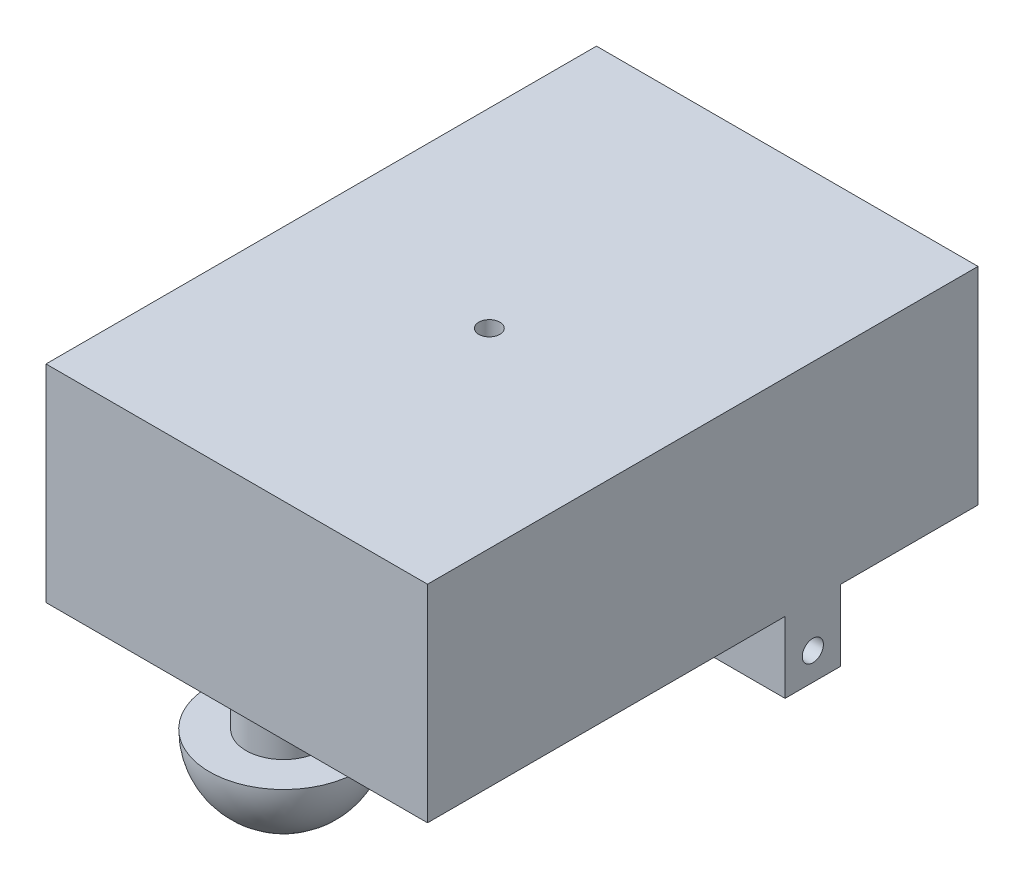
ISO-10303-21;
HEADER;
FILE_DESCRIPTION(('STEP AP214'),'2;1');
FILE_NAME('part.step','',(''),(''),'','','');
FILE_SCHEMA(('AUTOMOTIVE_DESIGN { 1 0 10303 214 1 1 1 1 }'));
ENDSEC;
DATA;
#1=APPLICATION_CONTEXT('core data for automotive mechanical design processes');
#2=APPLICATION_PROTOCOL_DEFINITION('international standard','automotive_design',2000,#1);
#3=PRODUCT_CONTEXT('',#1,'mechanical');
#4=PRODUCT('Part','Part','',(#3));
#5=PRODUCT_RELATED_PRODUCT_CATEGORY('part','',(#4));
#6=PRODUCT_DEFINITION_FORMATION('','',#4);
#7=PRODUCT_DEFINITION_CONTEXT('part definition',#1,'design');
#8=PRODUCT_DEFINITION('design','',#6,#7);
#9=PRODUCT_DEFINITION_SHAPE('','',#8);
#10=(LENGTH_UNIT() NAMED_UNIT(*) SI_UNIT(.MILLI.,.METRE.));
#11=(NAMED_UNIT(*) PLANE_ANGLE_UNIT() SI_UNIT($,.RADIAN.));
#12=(NAMED_UNIT(*) SI_UNIT($,.STERADIAN.) SOLID_ANGLE_UNIT());
#13=UNCERTAINTY_MEASURE_WITH_UNIT(LENGTH_MEASURE(1.E-05),#10,'distance_accuracy_value','');
#14=(GEOMETRIC_REPRESENTATION_CONTEXT(3) GLOBAL_UNCERTAINTY_ASSIGNED_CONTEXT((#13)) GLOBAL_UNIT_ASSIGNED_CONTEXT((#10,
#11,#12)) REPRESENTATION_CONTEXT('',''));
#15=CARTESIAN_POINT('',(0.,0.,0.));
#16=DIRECTION('',(0.,0.,1.));
#17=DIRECTION('',(1.,0.,0.));
#18=AXIS2_PLACEMENT_3D('',#15,#16,#17);
#19=CARTESIAN_POINT('',(0.,0.,0.));
#20=DIRECTION('',(0.,-1.,0.));
#21=DIRECTION('',(0.,0.,-1.));
#22=AXIS2_PLACEMENT_3D('',#19,#20,#21);
#23=PLANE('',#22);
#24=DIRECTION('',(0.,0.,-1.));
#25=VECTOR('',#24,1.);
#26=CARTESIAN_POINT('',(90.,0.,-129.855));
#27=LINE('',#26,#25);
#28=CARTESIAN_POINT('',(90.,0.,-65.035));
#29=VERTEX_POINT('',#28);
#30=CARTESIAN_POINT('',(90.,0.,-129.855));
#31=VERTEX_POINT('',#30);
#32=EDGE_CURVE('E169',#29,#31,#27,.T.);
#33=ORIENTED_EDGE('',*,*,#32,.F.);
#34=DIRECTION('',(1.,0.,0.));
#35=VECTOR('',#34,1.);
#36=CARTESIAN_POINT('',(-90.,0.,-65.035));
#37=LINE('',#36,#35);
#38=CARTESIAN_POINT('',(-90.,0.,-65.035));
#39=VERTEX_POINT('',#38);
#40=EDGE_CURVE('E48',#39,#29,#37,.T.);
#41=ORIENTED_EDGE('',*,*,#40,.F.);
#42=DIRECTION('',(0.,0.,1.));
#43=VECTOR('',#42,1.);
#44=CARTESIAN_POINT('',(-90.,0.,-129.855));
#45=LINE('',#44,#43);
#46=CARTESIAN_POINT('',(-90.,0.,-129.855));
#47=VERTEX_POINT('',#46);
#48=EDGE_CURVE('E164',#47,#39,#45,.T.);
#49=ORIENTED_EDGE('',*,*,#48,.F.);
#50=DIRECTION('',(-1.,0.,0.));
#51=VECTOR('',#50,1.);
#52=CARTESIAN_POINT('',(90.,0.,-129.855));
#53=LINE('',#52,#51);
#54=EDGE_CURVE('E78',#31,#47,#53,.T.);
#55=ORIENTED_EDGE('',*,*,#54,.F.);
#56=EDGE_LOOP('',(#33,#41,#49,#55));
#57=FACE_BOUND('',#56,.T.);
#58=ADVANCED_FACE('F33',(#57),#23,.T.);
#59=CARTESIAN_POINT('',(-90.,97.5,-129.855));
#60=DIRECTION('',(1.,0.,0.));
#61=DIRECTION('',(0.,0.,-1.));
#62=AXIS2_PLACEMENT_3D('',#59,#60,#61);
#63=PLANE('',#62);
#64=CARTESIAN_POINT('',(-90.0000000000001,-20.5,-51.935));
#65=DIRECTION('',(1.,0.,0.));
#66=DIRECTION('',(0.,0.,-1.));
#67=AXIS2_PLACEMENT_3D('',#64,#65,#66);
#68=CIRCLE('',#67,5.);
#69=CARTESIAN_POINT('',(-90.0000000000001,-20.5,-56.935));
#70=VERTEX_POINT('',#69);
#71=EDGE_CURVE('E141',#70,#70,#68,.T.);
#72=ORIENTED_EDGE('',*,*,#71,.T.);
#73=EDGE_LOOP('',(#72));
#74=FACE_BOUND('',#73,.T.);
#75=ORIENTED_EDGE('',*,*,#48,.T.);
#76=DIRECTION('',(0.,1.,0.));
#77=VECTOR('',#76,1.);
#78=CARTESIAN_POINT('',(-90.,-33.5,-65.035));
#79=LINE('',#78,#77);
#80=CARTESIAN_POINT('',(-90.,-33.5,-65.035));
#81=VERTEX_POINT('',#80);
#82=EDGE_CURVE('E145',#81,#39,#79,.T.);
#83=ORIENTED_EDGE('',*,*,#82,.F.);
#84=DIRECTION('',(0.,0.,-1.));
#85=VECTOR('',#84,1.);
#86=CARTESIAN_POINT('',(-90.,-33.5,-38.835));
#87=LINE('',#86,#85);
#88=CARTESIAN_POINT('',(-90.,-33.5,-38.835));
#89=VERTEX_POINT('',#88);
#90=EDGE_CURVE('E120',#89,#81,#87,.T.);
#91=ORIENTED_EDGE('',*,*,#90,.F.);
#92=DIRECTION('',(0.,1.,0.));
#93=VECTOR('',#92,1.);
#94=CARTESIAN_POINT('',(-90.,-33.5,-38.835));
#95=LINE('',#94,#93);
#96=CARTESIAN_POINT('',(-90.,0.,-38.835));
#97=VERTEX_POINT('',#96);
#98=EDGE_CURVE('E130',#89,#97,#95,.T.);
#99=ORIENTED_EDGE('',*,*,#98,.T.);
#100=CARTESIAN_POINT('',(-90.,0.,129.855));
#101=VERTEX_POINT('',#100);
#102=EDGE_CURVE('E154',#97,#101,#45,.T.);
#103=ORIENTED_EDGE('',*,*,#102,.T.);
#104=DIRECTION('',(0.,-1.,0.));
#105=VECTOR('',#104,1.);
#106=CARTESIAN_POINT('',(-90.,97.5,129.855));
#107=LINE('',#106,#105);
#108=CARTESIAN_POINT('',(-90.,97.5,129.855));
#109=VERTEX_POINT('',#108);
#110=EDGE_CURVE('E11',#109,#101,#107,.T.);
#111=ORIENTED_EDGE('',*,*,#110,.F.);
#112=DIRECTION('',(0.,0.,1.));
#113=VECTOR('',#112,1.);
#114=CARTESIAN_POINT('',(-90.,97.5,-129.855));
#115=LINE('',#114,#113);
#116=CARTESIAN_POINT('',(-90.,97.5,-129.855));
#117=VERTEX_POINT('',#116);
#118=EDGE_CURVE('E157',#117,#109,#115,.T.);
#119=ORIENTED_EDGE('',*,*,#118,.F.);
#120=DIRECTION('',(0.,-1.,0.));
#121=VECTOR('',#120,1.);
#122=CARTESIAN_POINT('',(-90.,97.5,-129.855));
#123=LINE('',#122,#121);
#124=EDGE_CURVE('E163',#117,#47,#123,.T.);
#125=ORIENTED_EDGE('',*,*,#124,.T.);
#126=EDGE_LOOP('',(#75,#83,#91,#99,#103,#111,#119,#125));
#127=FACE_BOUND('',#126,.T.);
#128=ADVANCED_FACE('F183',(#74,#127),#63,.F.);
#129=CARTESIAN_POINT('',(90.,97.5,129.855));
#130=DIRECTION('',(0.,0.,-1.));
#131=DIRECTION('',(-1.,0.,0.));
#132=AXIS2_PLACEMENT_3D('',#129,#130,#131);
#133=PLANE('',#132);
#134=DIRECTION('',(1.,0.,0.));
#135=VECTOR('',#134,1.);
#136=CARTESIAN_POINT('',(90.,0.,129.855));
#137=LINE('',#136,#135);
#138=CARTESIAN_POINT('',(90.,0.,129.855));
#139=VERTEX_POINT('',#138);
#140=EDGE_CURVE('E167',#101,#139,#137,.T.);
#141=ORIENTED_EDGE('',*,*,#140,.T.);
#142=DIRECTION('',(0.,-1.,0.));
#143=VECTOR('',#142,1.);
#144=CARTESIAN_POINT('',(90.,97.5,129.855));
#145=LINE('',#144,#143);
#146=CARTESIAN_POINT('',(90.,97.5,129.855));
#147=VERTEX_POINT('',#146);
#148=EDGE_CURVE('E41',#147,#139,#145,.T.);
#149=ORIENTED_EDGE('',*,*,#148,.F.);
#150=DIRECTION('',(1.,0.,0.));
#151=VECTOR('',#150,1.);
#152=CARTESIAN_POINT('',(90.,97.5,129.855));
#153=LINE('',#152,#151);
#154=EDGE_CURVE('E85',#109,#147,#153,.T.);
#155=ORIENTED_EDGE('',*,*,#154,.F.);
#156=ORIENTED_EDGE('',*,*,#110,.T.);
#157=EDGE_LOOP('',(#141,#149,#155,#156));
#158=FACE_BOUND('',#157,.T.);
#159=ADVANCED_FACE('F195',(#158),#133,.F.);
#160=CARTESIAN_POINT('',(90.,97.5,-129.855));
#161=DIRECTION('',(-1.,0.,0.));
#162=DIRECTION('',(0.,0.,1.));
#163=AXIS2_PLACEMENT_3D('',#160,#161,#162);
#164=PLANE('',#163);
#165=CARTESIAN_POINT('',(90.,-20.5,-51.935));
#166=DIRECTION('',(1.,0.,0.));
#167=DIRECTION('',(0.,0.,-1.));
#168=AXIS2_PLACEMENT_3D('',#165,#166,#167);
#169=CIRCLE('',#168,5.);
#170=CARTESIAN_POINT('',(90.,-20.5,-56.935));
#171=VERTEX_POINT('',#170);
#172=EDGE_CURVE('E136',#171,#171,#169,.T.);
#173=ORIENTED_EDGE('',*,*,#172,.F.);
#174=EDGE_LOOP('',(#173));
#175=FACE_BOUND('',#174,.T.);
#176=CARTESIAN_POINT('',(90.,0.,-38.835));
#177=VERTEX_POINT('',#176);
#178=EDGE_CURVE('E114',#139,#177,#27,.T.);
#179=ORIENTED_EDGE('',*,*,#178,.T.);
#180=DIRECTION('',(0.,1.,0.));
#181=VECTOR('',#180,1.);
#182=CARTESIAN_POINT('',(90.,-33.5,-38.835));
#183=LINE('',#182,#181);
#184=CARTESIAN_POINT('',(90.,-33.5,-38.835));
#185=VERTEX_POINT('',#184);
#186=EDGE_CURVE('E108',#185,#177,#183,.T.);
#187=ORIENTED_EDGE('',*,*,#186,.F.);
#188=DIRECTION('',(0.,0.,-1.));
#189=VECTOR('',#188,1.);
#190=CARTESIAN_POINT('',(90.,-33.5,-38.835));
#191=LINE('',#190,#189);
#192=CARTESIAN_POINT('',(90.,-33.5,-65.035));
#193=VERTEX_POINT('',#192);
#194=EDGE_CURVE('E111',#185,#193,#191,.T.);
#195=ORIENTED_EDGE('',*,*,#194,.T.);
#196=DIRECTION('',(0.,1.,0.));
#197=VECTOR('',#196,1.);
#198=CARTESIAN_POINT('',(90.,-33.5,-65.035));
#199=LINE('',#198,#197);
#200=EDGE_CURVE('E119',#193,#29,#199,.T.);
#201=ORIENTED_EDGE('',*,*,#200,.T.);
#202=ORIENTED_EDGE('',*,*,#32,.T.);
#203=DIRECTION('',(0.,-1.,0.));
#204=VECTOR('',#203,1.);
#205=CARTESIAN_POINT('',(90.,97.5,-129.855));
#206=LINE('',#205,#204);
#207=CARTESIAN_POINT('',(90.,97.5,-129.855));
#208=VERTEX_POINT('',#207);
#209=EDGE_CURVE('E173',#208,#31,#206,.T.);
#210=ORIENTED_EDGE('',*,*,#209,.F.);
#211=DIRECTION('',(0.,0.,-1.));
#212=VECTOR('',#211,1.);
#213=CARTESIAN_POINT('',(90.,97.5,-129.855));
#214=LINE('',#213,#212);
#215=EDGE_CURVE('E160',#147,#208,#214,.T.);
#216=ORIENTED_EDGE('',*,*,#215,.F.);
#217=ORIENTED_EDGE('',*,*,#148,.T.);
#218=EDGE_LOOP('',(#179,#187,#195,#201,#202,#210,#216,#217));
#219=FACE_BOUND('',#218,.T.);
#220=ADVANCED_FACE('F110',(#175,#219),#164,.F.);
#221=CARTESIAN_POINT('',(90.,97.5,-129.855));
#222=DIRECTION('',(0.,0.,1.));
#223=DIRECTION('',(1.,0.,0.));
#224=AXIS2_PLACEMENT_3D('',#221,#222,#223);
#225=PLANE('',#224);
#226=ORIENTED_EDGE('',*,*,#54,.T.);
#227=ORIENTED_EDGE('',*,*,#124,.F.);
#228=DIRECTION('',(-1.,0.,0.));
#229=VECTOR('',#228,1.);
#230=CARTESIAN_POINT('',(90.,97.5,-129.855));
#231=LINE('',#230,#229);
#232=EDGE_CURVE('E57',#208,#117,#231,.T.);
#233=ORIENTED_EDGE('',*,*,#232,.F.);
#234=ORIENTED_EDGE('',*,*,#209,.T.);
#235=EDGE_LOOP('',(#226,#227,#233,#234));
#236=FACE_BOUND('',#235,.T.);
#237=ADVANCED_FACE('F210',(#236),#225,.F.);
#238=CARTESIAN_POINT('',(0.,97.5,0.));
#239=DIRECTION('',(0.,-1.,0.));
#240=DIRECTION('',(0.,0.,-1.));
#241=AXIS2_PLACEMENT_3D('',#238,#239,#240);
#242=PLANE('',#241);
#243=CARTESIAN_POINT('',(0.,97.5,10.705));
#244=DIRECTION('',(0.,1.,0.));
#245=DIRECTION('',(0.,0.,1.));
#246=AXIS2_PLACEMENT_3D('',#243,#244,#245);
#247=CIRCLE('',#246,5.);
#248=CARTESIAN_POINT('',(0.,97.5,15.705));
#249=VERTEX_POINT('',#248);
#250=EDGE_CURVE('E243',#249,#249,#247,.T.);
#251=ORIENTED_EDGE('',*,*,#250,.F.);
#252=EDGE_LOOP('',(#251));
#253=FACE_BOUND('',#252,.T.);
#254=ORIENTED_EDGE('',*,*,#118,.T.);
#255=ORIENTED_EDGE('',*,*,#154,.T.);
#256=ORIENTED_EDGE('',*,*,#215,.T.);
#257=ORIENTED_EDGE('',*,*,#232,.T.);
#258=EDGE_LOOP('',(#254,#255,#256,#257));
#259=FACE_BOUND('',#258,.T.);
#260=ADVANCED_FACE('F201',(#253,#259),#242,.F.);
#261=DIRECTION('',(1.,0.,0.));
#262=VECTOR('',#261,1.);
#263=CARTESIAN_POINT('',(-90.,0.,-38.835));
#264=LINE('',#263,#262);
#265=EDGE_CURVE('E133',#97,#177,#264,.T.);
#266=ORIENTED_EDGE('',*,*,#265,.T.);
#267=ORIENTED_EDGE('',*,*,#178,.F.);
#268=ORIENTED_EDGE('',*,*,#140,.F.);
#269=ORIENTED_EDGE('',*,*,#102,.F.);
#270=EDGE_LOOP('',(#266,#267,#268,#269));
#271=FACE_BOUND('',#270,.T.);
#272=CARTESIAN_POINT('',(0.,0.,107.765));
#273=DIRECTION('',(0.,-1.,0.));
#274=DIRECTION('',(0.,0.,-1.));
#275=AXIS2_PLACEMENT_3D('',#272,#273,#274);
#276=CIRCLE('',#275,17.7);
#277=CARTESIAN_POINT('',(0.,0.,90.065));
#278=VERTEX_POINT('',#277);
#279=EDGE_CURVE('E150',#278,#278,#276,.T.);
#280=ORIENTED_EDGE('',*,*,#279,.F.);
#281=EDGE_LOOP('',(#280));
#282=FACE_BOUND('',#281,.T.);
#283=ADVANCED_FACE('F178',(#271,#282),#23,.T.);
#284=CARTESIAN_POINT('',(0.,-17.7,107.765));
#285=DIRECTION('',(0.,1.,0.));
#286=DIRECTION('',(0.,0.,1.));
#287=AXIS2_PLACEMENT_3D('',#284,#285,#286);
#288=CYLINDRICAL_SURFACE('',#287,17.7);
#289=CARTESIAN_POINT('',(0.,-17.7,107.765));
#290=DIRECTION('',(0.,-1.,0.));
#291=DIRECTION('',(0.,0.,-1.));
#292=AXIS2_PLACEMENT_3D('',#289,#290,#291);
#293=CIRCLE('',#292,17.7);
#294=CARTESIAN_POINT('',(0.,-17.7,90.065));
#295=VERTEX_POINT('',#294);
#296=EDGE_CURVE('E151',#295,#295,#293,.T.);
#297=ORIENTED_EDGE('',*,*,#296,.F.);
#298=EDGE_LOOP('',(#297));
#299=FACE_BOUND('',#298,.T.);
#300=ORIENTED_EDGE('',*,*,#279,.T.);
#301=EDGE_LOOP('',(#300));
#302=FACE_BOUND('',#301,.T.);
#303=ADVANCED_FACE('F200',(#299,#302),#288,.T.);
#304=CARTESIAN_POINT('',(0.,-17.7,107.765));
#305=DIRECTION('',(0.,-1.,0.));
#306=DIRECTION('',(0.,0.,-1.));
#307=AXIS2_PLACEMENT_3D('',#304,#305,#306);
#308=PLANE('',#307);
#309=ORIENTED_EDGE('',*,*,#296,.T.);
#310=EDGE_LOOP('',(#309));
#311=FACE_BOUND('',#310,.T.);
#312=CARTESIAN_POINT('',(0.,-17.7,107.765));
#313=DIRECTION('',(0.,-1.,0.));
#314=DIRECTION('',(0.,0.,-1.));
#315=AXIS2_PLACEMENT_3D('',#312,#313,#314);
#316=CIRCLE('',#315,35.);
#317=CARTESIAN_POINT('',(0.,-17.7,72.765));
#318=VERTEX_POINT('',#317);
#319=EDGE_CURVE('E144',#318,#318,#316,.T.);
#320=ORIENTED_EDGE('',*,*,#319,.F.);
#321=EDGE_LOOP('',(#320));
#322=FACE_BOUND('',#321,.T.);
#323=ADVANCED_FACE('F206',(#311,#322),#308,.F.);
#324=CARTESIAN_POINT('',(0.,-17.7,107.765));
#325=DIRECTION('',(0.,-1.,0.));
#326=DIRECTION('',(0.,0.,-1.));
#327=AXIS2_PLACEMENT_3D('',#324,#325,#326);
#328=SPHERICAL_SURFACE('',#327,35.);
#329=ORIENTED_EDGE('',*,*,#319,.T.);
#330=EDGE_LOOP('',(#329));
#331=FACE_BOUND('',#330,.T.);
#332=ADVANCED_FACE('F35',(#331),#328,.T.);
#333=CARTESIAN_POINT('',(-90.,-33.5,-38.835));
#334=DIRECTION('',(0.,0.,1.));
#335=DIRECTION('',(1.,0.,0.));
#336=AXIS2_PLACEMENT_3D('',#333,#334,#335);
#337=PLANE('',#336);
#338=ORIENTED_EDGE('',*,*,#265,.F.);
#339=ORIENTED_EDGE('',*,*,#98,.F.);
#340=DIRECTION('',(1.,0.,0.));
#341=VECTOR('',#340,1.);
#342=CARTESIAN_POINT('',(-90.,-33.5,-38.835));
#343=LINE('',#342,#341);
#344=EDGE_CURVE('E125',#89,#185,#343,.T.);
#345=ORIENTED_EDGE('',*,*,#344,.T.);
#346=ORIENTED_EDGE('',*,*,#186,.T.);
#347=EDGE_LOOP('',(#338,#339,#345,#346));
#348=FACE_BOUND('',#347,.T.);
#349=ADVANCED_FACE('F129',(#348),#337,.T.);
#350=CARTESIAN_POINT('',(-90.,-33.5,-65.035));
#351=DIRECTION('',(0.,0.,1.));
#352=DIRECTION('',(1.,0.,0.));
#353=AXIS2_PLACEMENT_3D('',#350,#351,#352);
#354=PLANE('',#353);
#355=ORIENTED_EDGE('',*,*,#40,.T.);
#356=ORIENTED_EDGE('',*,*,#200,.F.);
#357=DIRECTION('',(1.,0.,0.));
#358=VECTOR('',#357,1.);
#359=CARTESIAN_POINT('',(-90.,-33.5,-65.035));
#360=LINE('',#359,#358);
#361=EDGE_CURVE('E127',#81,#193,#360,.T.);
#362=ORIENTED_EDGE('',*,*,#361,.F.);
#363=ORIENTED_EDGE('',*,*,#82,.T.);
#364=EDGE_LOOP('',(#355,#356,#362,#363));
#365=FACE_BOUND('',#364,.T.);
#366=ADVANCED_FACE('F187',(#365),#354,.F.);
#367=CARTESIAN_POINT('',(0.,-33.5,0.));
#368=DIRECTION('',(0.,1.,0.));
#369=DIRECTION('',(0.,0.,1.));
#370=AXIS2_PLACEMENT_3D('',#367,#368,#369);
#371=PLANE('',#370);
#372=ORIENTED_EDGE('',*,*,#344,.F.);
#373=ORIENTED_EDGE('',*,*,#90,.T.);
#374=ORIENTED_EDGE('',*,*,#361,.T.);
#375=ORIENTED_EDGE('',*,*,#194,.F.);
#376=EDGE_LOOP('',(#372,#373,#374,#375));
#377=FACE_BOUND('',#376,.T.);
#378=ADVANCED_FACE('F124',(#377),#371,.F.);
#379=CARTESIAN_POINT('',(-90.0000000000001,-20.5,-51.935));
#380=DIRECTION('',(1.,0.,0.));
#381=DIRECTION('',(0.,0.,-1.));
#382=AXIS2_PLACEMENT_3D('',#379,#380,#381);
#383=CYLINDRICAL_SURFACE('',#382,5.);
#384=CARTESIAN_POINT('',(-90.0000000000001,-20.5,-56.935));
#385=CARTESIAN_POINT('',(-88.1250000000001,-20.5,-56.935));
#386=CARTESIAN_POINT('',(-86.2500000000001,-20.5,-56.935));
#387=CARTESIAN_POINT('',(-82.5000000000001,-20.5,-56.935));
#388=CARTESIAN_POINT('',(-80.6250000000001,-20.5,-56.935));
#389=CARTESIAN_POINT('',(-76.8750000000001,-20.5,-56.935));
#390=CARTESIAN_POINT('',(-75.0000000000001,-20.5,-56.935));
#391=CARTESIAN_POINT('',(-71.25,-20.5,-56.935));
#392=CARTESIAN_POINT('',(-69.3750000000001,-20.5,-56.935));
#393=CARTESIAN_POINT('',(-65.6250000000001,-20.5,-56.935));
#394=CARTESIAN_POINT('',(-63.7500000000001,-20.5,-56.935));
#395=CARTESIAN_POINT('',(-60.0000000000001,-20.5,-56.935));
#396=CARTESIAN_POINT('',(-58.1250000000001,-20.5,-56.935));
#397=CARTESIAN_POINT('',(-54.3750000000001,-20.5,-56.935));
#398=CARTESIAN_POINT('',(-52.5000000000001,-20.5,-56.935));
#399=CARTESIAN_POINT('',(-48.7500000000001,-20.5,-56.935));
#400=CARTESIAN_POINT('',(-46.8750000000001,-20.5,-56.935));
#401=CARTESIAN_POINT('',(-43.125,-20.5,-56.935));
#402=CARTESIAN_POINT('',(-41.25,-20.5,-56.935));
#403=CARTESIAN_POINT('',(-37.5,-20.5,-56.935));
#404=CARTESIAN_POINT('',(-35.625,-20.5,-56.935));
#405=CARTESIAN_POINT('',(-31.875,-20.5,-56.935));
#406=CARTESIAN_POINT('',(-30.,-20.5,-56.935));
#407=CARTESIAN_POINT('',(-26.2500000000001,-20.5,-56.935));
#408=CARTESIAN_POINT('',(-24.3750000000001,-20.5,-56.935));
#409=CARTESIAN_POINT('',(-20.6250000000001,-20.5,-56.935));
#410=CARTESIAN_POINT('',(-18.7500000000001,-20.5,-56.935));
#411=CARTESIAN_POINT('',(-15.0000000000001,-20.5,-56.935));
#412=CARTESIAN_POINT('',(-13.1250000000001,-20.5,-56.935));
#413=CARTESIAN_POINT('',(-9.37500000000006,-20.5,-56.935));
#414=CARTESIAN_POINT('',(-7.50000000000006,-20.5,-56.935));
#415=CARTESIAN_POINT('',(-3.75000000000006,-20.5,-56.935));
#416=CARTESIAN_POINT('',(-1.87500000000006,-20.5,-56.935));
#417=CARTESIAN_POINT('',(1.87499999999995,-20.5,-56.935));
#418=CARTESIAN_POINT('',(3.74999999999995,-20.5,-56.935));
#419=CARTESIAN_POINT('',(7.49999999999995,-20.5,-56.935));
#420=CARTESIAN_POINT('',(9.37499999999995,-20.5,-56.935));
#421=CARTESIAN_POINT('',(13.125,-20.5,-56.935));
#422=CARTESIAN_POINT('',(14.9999999999999,-20.5,-56.935));
#423=CARTESIAN_POINT('',(18.7499999999999,-20.5,-56.935));
#424=CARTESIAN_POINT('',(20.625,-20.5,-56.935));
#425=CARTESIAN_POINT('',(24.375,-20.5,-56.935));
#426=CARTESIAN_POINT('',(26.25,-20.5,-56.935));
#427=CARTESIAN_POINT('',(30.,-20.5,-56.935));
#428=CARTESIAN_POINT('',(31.875,-20.5,-56.935));
#429=CARTESIAN_POINT('',(35.625,-20.5,-56.935));
#430=CARTESIAN_POINT('',(37.5,-20.5,-56.935));
#431=CARTESIAN_POINT('',(41.25,-20.5,-56.935));
#432=CARTESIAN_POINT('',(43.125,-20.5,-56.935));
#433=CARTESIAN_POINT('',(46.875,-20.5,-56.935));
#434=CARTESIAN_POINT('',(48.75,-20.5,-56.935));
#435=CARTESIAN_POINT('',(52.5,-20.5,-56.935));
#436=CARTESIAN_POINT('',(54.375,-20.5,-56.935));
#437=CARTESIAN_POINT('',(58.125,-20.5,-56.935));
#438=CARTESIAN_POINT('',(60.,-20.5,-56.935));
#439=CARTESIAN_POINT('',(63.75,-20.5,-56.935));
#440=CARTESIAN_POINT('',(65.6249999999999,-20.5,-56.935));
#441=CARTESIAN_POINT('',(69.375,-20.5,-56.935));
#442=CARTESIAN_POINT('',(71.25,-20.5,-56.935));
#443=CARTESIAN_POINT('',(75.,-20.5,-56.935));
#444=CARTESIAN_POINT('',(76.875,-20.5,-56.935));
#445=CARTESIAN_POINT('',(80.625,-20.5,-56.935));
#446=CARTESIAN_POINT('',(82.5,-20.5,-56.935));
#447=CARTESIAN_POINT('',(86.25,-20.5,-56.935));
#448=CARTESIAN_POINT('',(88.125,-20.5,-56.935));
#449=CARTESIAN_POINT('',(90.,-20.5,-56.935));
#450=B_SPLINE_CURVE_WITH_KNOTS('',3,(#384,#385,#386,#387,#388,#389,#390,#391,#392,#393,#394,
#395,#396,#397,#398,#399,#400,#401,#402,#403,#404,#405,#406,#407,#408,#409,#410,#411,#412,#413,
#414,#415,#416,#417,#418,#419,#420,#421,#422,#423,#424,#425,#426,#427,#428,#429,#430,#431,#432,
#433,#434,#435,#436,#437,#438,#439,#440,#441,#442,#443,#444,#445,#446,#447,#448,#449),
.UNSPECIFIED.,.F.,.F.,(4,2,2,2,2,2,2,2,2,2,2,2,2,2,2,2,2,2,2,2,2,2,2,2,2,2,2,2,2,2,2,2,4),(0.,
5.62500000000001,11.25,16.875,22.5,28.125,33.75,39.375,45.,50.625,56.25,61.875,67.5,73.125,
78.75,84.375,90.,95.625,101.25,106.875,112.5,118.125,123.75,129.375,135.,140.625,146.25,151.875,
157.5,163.125,168.75,174.375,180.),.UNSPECIFIED.);
#451=EDGE_CURVE('BSEAM227',#70,#171,#450,.T.);
#452=ORIENTED_EDGE('',*,*,#71,.F.);
#453=ORIENTED_EDGE('',*,*,#172,.T.);
#454=ORIENTED_EDGE('',*,*,#451,.T.);
#455=ORIENTED_EDGE('',*,*,#451,.F.);
#456=EDGE_LOOP('',(#452,#454,#453,#455));
#457=FACE_BOUND('',#456,.T.);
#458=ADVANCED_FACE('F227',(#457),#383,.F.);
#459=CARTESIAN_POINT('',(0.,87.5,10.705));
#460=DIRECTION('',(0.,1.,0.));
#461=DIRECTION('',(0.,0.,1.));
#462=AXIS2_PLACEMENT_3D('',#459,#460,#461);
#463=CYLINDRICAL_SURFACE('',#462,5.);
#464=CARTESIAN_POINT('',(0.,87.5,10.705));
#465=DIRECTION('',(0.,1.,0.));
#466=DIRECTION('',(0.,0.,1.));
#467=AXIS2_PLACEMENT_3D('',#464,#465,#466);
#468=CIRCLE('',#467,5.);
#469=CARTESIAN_POINT('',(0.,87.5,15.705));
#470=VERTEX_POINT('',#469);
#471=EDGE_CURVE('E242',#470,#470,#468,.T.);
#472=ORIENTED_EDGE('',*,*,#471,.F.);
#473=EDGE_LOOP('',(#472));
#474=FACE_BOUND('',#473,.T.);
#475=ORIENTED_EDGE('',*,*,#250,.T.);
#476=EDGE_LOOP('',(#475));
#477=FACE_BOUND('',#476,.T.);
#478=ADVANCED_FACE('F230',(#474,#477),#463,.F.);
#479=CARTESIAN_POINT('',(0.,87.5,10.705));
#480=DIRECTION('',(0.,1.,0.));
#481=DIRECTION('',(0.,0.,1.));
#482=AXIS2_PLACEMENT_3D('',#479,#480,#481);
#483=PLANE('',#482);
#484=ORIENTED_EDGE('',*,*,#471,.T.);
#485=EDGE_LOOP('',(#484));
#486=FACE_BOUND('',#485,.T.);
#487=ADVANCED_FACE('F234',(#486),#483,.T.);
#488=CLOSED_SHELL('',(#58,#128,#159,#220,#237,#260,#283,#303,#323,#332,#349,#366,#378,#458,#478,#487));
#489=MANIFOLD_SOLID_BREP('B2',#488);
#490=ADVANCED_BREP_SHAPE_REPRESENTATION('',(#18,#489),#14);
#491=SHAPE_DEFINITION_REPRESENTATION(#9,#490);
ENDSEC;
END-ISO-10303-21;
